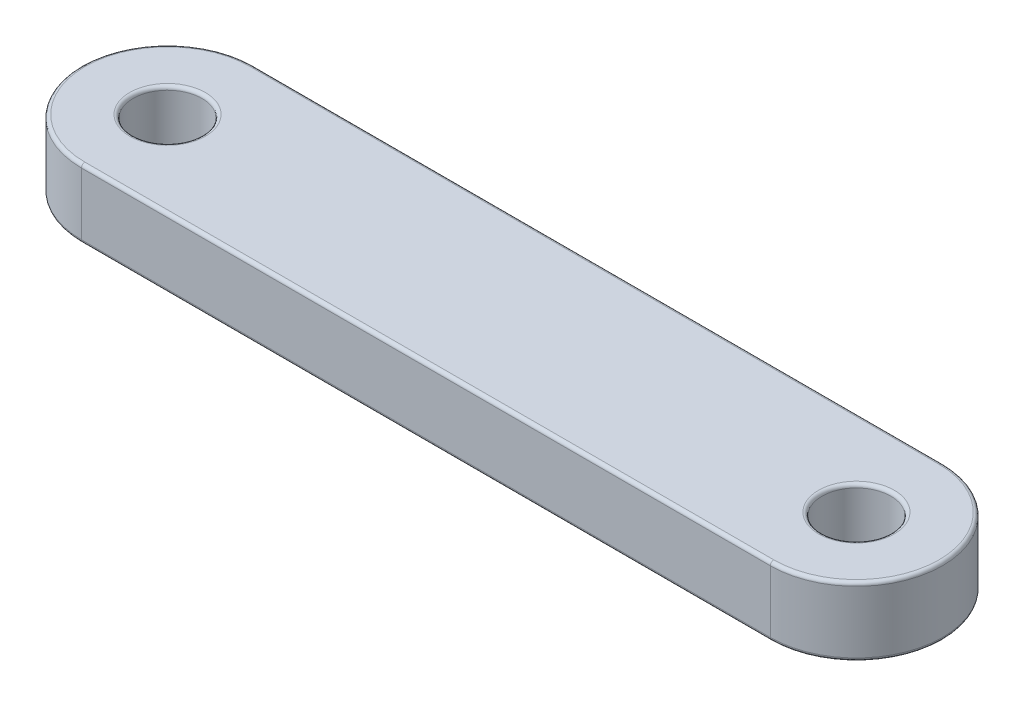
ISO-10303-21;
HEADER;
FILE_DESCRIPTION(('STEP AP214'),'2;1');
FILE_NAME('part.step','',(''),(''),'','','');
FILE_SCHEMA(('AUTOMOTIVE_DESIGN { 1 0 10303 214 1 1 1 1 }'));
ENDSEC;
DATA;
#1=APPLICATION_CONTEXT('core data for automotive mechanical design processes');
#2=APPLICATION_PROTOCOL_DEFINITION('international standard','automotive_design',2000,#1);
#3=PRODUCT_CONTEXT('',#1,'mechanical');
#4=PRODUCT('Part','Part','',(#3));
#5=PRODUCT_RELATED_PRODUCT_CATEGORY('part','',(#4));
#6=PRODUCT_DEFINITION_FORMATION('','',#4);
#7=PRODUCT_DEFINITION_CONTEXT('part definition',#1,'design');
#8=PRODUCT_DEFINITION('design','',#6,#7);
#9=PRODUCT_DEFINITION_SHAPE('','',#8);
#10=(LENGTH_UNIT() NAMED_UNIT(*) SI_UNIT(.MILLI.,.METRE.));
#11=(NAMED_UNIT(*) PLANE_ANGLE_UNIT() SI_UNIT($,.RADIAN.));
#12=(NAMED_UNIT(*) SI_UNIT($,.STERADIAN.) SOLID_ANGLE_UNIT());
#13=UNCERTAINTY_MEASURE_WITH_UNIT(LENGTH_MEASURE(1.E-05),#10,'distance_accuracy_value','');
#14=(GEOMETRIC_REPRESENTATION_CONTEXT(3) GLOBAL_UNCERTAINTY_ASSIGNED_CONTEXT((#13)) GLOBAL_UNIT_ASSIGNED_CONTEXT((#10,
#11,#12)) REPRESENTATION_CONTEXT('',''));
#15=CARTESIAN_POINT('',(0.,0.,0.));
#16=DIRECTION('',(0.,0.,1.));
#17=DIRECTION('',(1.,0.,0.));
#18=AXIS2_PLACEMENT_3D('',#15,#16,#17);
#19=CARTESIAN_POINT('',(-12.5,11.25,0.));
#20=DIRECTION('',(0.,1.,0.));
#21=DIRECTION('',(0.,0.,1.));
#22=AXIS2_PLACEMENT_3D('',#19,#20,#21);
#23=PLANE('',#22);
#24=CARTESIAN_POINT('',(12.5,11.25,0.));
#25=DIRECTION('',(0.,1.,0.));
#26=DIRECTION('',(0.,0.,1.));
#27=AXIS2_PLACEMENT_3D('',#24,#25,#26);
#28=CIRCLE('',#27,1.375);
#29=CARTESIAN_POINT('',(12.5,11.25,1.37499999999998));
#30=VERTEX_POINT('',#29);
#31=EDGE_CURVE('E11',#30,#30,#28,.F.);
#32=ORIENTED_EDGE('',*,*,#31,.T.);
#33=EDGE_LOOP('',(#32));
#34=FACE_BOUND('',#33,.T.);
#35=CARTESIAN_POINT('',(12.5,11.25,0.));
#36=DIRECTION('',(0.,1.,0.));
#37=DIRECTION('',(0.,0.,1.));
#38=AXIS2_PLACEMENT_3D('',#35,#36,#37);
#39=CIRCLE('',#38,3.);
#40=CARTESIAN_POINT('',(12.5,11.25,2.99999999999998));
#41=VERTEX_POINT('',#40);
#42=CARTESIAN_POINT('',(12.5,11.25,-3.00000000000002));
#43=VERTEX_POINT('',#42);
#44=EDGE_CURVE('E53',#41,#43,#39,.T.);
#45=ORIENTED_EDGE('',*,*,#44,.T.);
#46=DIRECTION('',(-1.,0.,0.));
#47=VECTOR('',#46,1.);
#48=CARTESIAN_POINT('',(-12.5,11.25,-3.00000000000002));
#49=LINE('',#48,#47);
#50=CARTESIAN_POINT('',(-12.5,11.25,-3.00000000000002));
#51=VERTEX_POINT('',#50);
#52=EDGE_CURVE('E45',#43,#51,#49,.T.);
#53=ORIENTED_EDGE('',*,*,#52,.T.);
#54=CARTESIAN_POINT('',(-12.5,11.25,0.));
#55=DIRECTION('',(0.,1.,0.));
#56=DIRECTION('',(0.,0.,1.));
#57=AXIS2_PLACEMENT_3D('',#54,#55,#56);
#58=CIRCLE('',#57,3.);
#59=CARTESIAN_POINT('',(-12.5,11.25,2.99999999999998));
#60=VERTEX_POINT('',#59);
#61=EDGE_CURVE('E171',#51,#60,#58,.T.);
#62=ORIENTED_EDGE('',*,*,#61,.T.);
#63=DIRECTION('',(1.,0.,0.));
#64=VECTOR('',#63,1.);
#65=CARTESIAN_POINT('',(12.5,11.25,2.99999999999998));
#66=LINE('',#65,#64);
#67=EDGE_CURVE('E58',#60,#41,#66,.T.);
#68=ORIENTED_EDGE('',*,*,#67,.T.);
#69=EDGE_LOOP('',(#45,#53,#62,#68));
#70=FACE_BOUND('',#69,.T.);
#71=CARTESIAN_POINT('',(-12.5,11.25,0.));
#72=DIRECTION('',(0.,1.,0.));
#73=DIRECTION('',(0.,0.,1.));
#74=AXIS2_PLACEMENT_3D('',#71,#72,#73);
#75=CIRCLE('',#74,1.375);
#76=CARTESIAN_POINT('',(-12.5,11.25,1.37499999999998));
#77=VERTEX_POINT('',#76);
#78=EDGE_CURVE('E168',#77,#77,#75,.F.);
#79=ORIENTED_EDGE('',*,*,#78,.T.);
#80=EDGE_LOOP('',(#79));
#81=FACE_BOUND('',#80,.T.);
#82=ADVANCED_FACE('F36',(#34,#70,#81),#23,.T.);
#83=CARTESIAN_POINT('',(-12.5,8.75,0.));
#84=DIRECTION('',(0.,1.,0.));
#85=DIRECTION('',(0.,0.,1.));
#86=AXIS2_PLACEMENT_3D('',#83,#84,#85);
#87=PLANE('',#86);
#88=CARTESIAN_POINT('',(12.5,8.75,0.));
#89=DIRECTION('',(0.,1.,0.));
#90=DIRECTION('',(0.,0.,1.));
#91=AXIS2_PLACEMENT_3D('',#88,#89,#90);
#92=CIRCLE('',#91,1.375);
#93=CARTESIAN_POINT('',(12.5,8.75,1.37499999999998));
#94=VERTEX_POINT('',#93);
#95=EDGE_CURVE('E133',#94,#94,#92,.T.);
#96=ORIENTED_EDGE('',*,*,#95,.T.);
#97=EDGE_LOOP('',(#96));
#98=FACE_BOUND('',#97,.T.);
#99=CARTESIAN_POINT('',(-12.5,8.75,0.));
#100=DIRECTION('',(0.,1.,0.));
#101=DIRECTION('',(0.,0.,1.));
#102=AXIS2_PLACEMENT_3D('',#99,#100,#101);
#103=CIRCLE('',#102,1.375);
#104=CARTESIAN_POINT('',(-12.5,8.75,1.37499999999998));
#105=VERTEX_POINT('',#104);
#106=EDGE_CURVE('E130',#105,#105,#103,.T.);
#107=ORIENTED_EDGE('',*,*,#106,.T.);
#108=EDGE_LOOP('',(#107));
#109=FACE_BOUND('',#108,.T.);
#110=CARTESIAN_POINT('',(12.5,8.75,0.));
#111=DIRECTION('',(0.,1.,0.));
#112=DIRECTION('',(0.,0.,1.));
#113=AXIS2_PLACEMENT_3D('',#110,#111,#112);
#114=CIRCLE('',#113,3.);
#115=CARTESIAN_POINT('',(12.5,8.75,-3.00000000000002));
#116=VERTEX_POINT('',#115);
#117=CARTESIAN_POINT('',(12.5,8.75,2.99999999999998));
#118=VERTEX_POINT('',#117);
#119=EDGE_CURVE('E129',#116,#118,#114,.F.);
#120=ORIENTED_EDGE('',*,*,#119,.T.);
#121=DIRECTION('',(1.,0.,0.));
#122=VECTOR('',#121,1.);
#123=CARTESIAN_POINT('',(-12.5,8.75,2.99999999999998));
#124=LINE('',#123,#122);
#125=CARTESIAN_POINT('',(-12.5,8.75,2.99999999999998));
#126=VERTEX_POINT('',#125);
#127=EDGE_CURVE('E108',#118,#126,#124,.F.);
#128=ORIENTED_EDGE('',*,*,#127,.T.);
#129=CARTESIAN_POINT('',(-12.5,8.75,0.));
#130=DIRECTION('',(0.,1.,0.));
#131=DIRECTION('',(0.,0.,1.));
#132=AXIS2_PLACEMENT_3D('',#129,#130,#131);
#133=CIRCLE('',#132,3.);
#134=CARTESIAN_POINT('',(-12.5,8.75,-3.00000000000002));
#135=VERTEX_POINT('',#134);
#136=EDGE_CURVE('E118',#126,#135,#133,.F.);
#137=ORIENTED_EDGE('',*,*,#136,.T.);
#138=DIRECTION('',(-1.,0.,0.));
#139=VECTOR('',#138,1.);
#140=CARTESIAN_POINT('',(-12.5,8.75,-3.00000000000002));
#141=LINE('',#140,#139);
#142=EDGE_CURVE('E124',#135,#116,#141,.F.);
#143=ORIENTED_EDGE('',*,*,#142,.T.);
#144=EDGE_LOOP('',(#120,#128,#137,#143));
#145=FACE_BOUND('',#144,.T.);
#146=ADVANCED_FACE('F127',(#98,#109,#145),#87,.F.);
#147=CARTESIAN_POINT('',(-12.5,11.25,0.));
#148=DIRECTION('',(0.,-1.,0.));
#149=DIRECTION('',(0.,0.,-1.));
#150=AXIS2_PLACEMENT_3D('',#147,#148,#149);
#151=CYLINDRICAL_SURFACE('',#150,3.125);
#152=DIRECTION('',(0.,-1.,0.));
#153=VECTOR('',#152,1.);
#154=CARTESIAN_POINT('',(-12.5,11.25,-3.12500000000002));
#155=LINE('',#154,#153);
#156=CARTESIAN_POINT('',(-12.5,11.125,-3.12500000000002));
#157=VERTEX_POINT('',#156);
#158=CARTESIAN_POINT('',(-12.5,8.875,-3.12500000000002));
#159=VERTEX_POINT('',#158);
#160=EDGE_CURVE('E180',#157,#159,#155,.T.);
#161=ORIENTED_EDGE('',*,*,#160,.T.);
#162=CARTESIAN_POINT('',(-12.5,8.875,0.));
#163=DIRECTION('',(0.,1.,0.));
#164=DIRECTION('',(0.,0.,1.));
#165=AXIS2_PLACEMENT_3D('',#162,#163,#164);
#166=CIRCLE('',#165,3.125);
#167=CARTESIAN_POINT('',(-12.5,8.875,3.12499999999998));
#168=VERTEX_POINT('',#167);
#169=EDGE_CURVE('E166',#159,#168,#166,.T.);
#170=ORIENTED_EDGE('',*,*,#169,.T.);
#171=DIRECTION('',(0.,-1.,0.));
#172=VECTOR('',#171,1.);
#173=CARTESIAN_POINT('',(-12.5,11.25,3.12499999999998));
#174=LINE('',#173,#172);
#175=CARTESIAN_POINT('',(-12.5,11.125,3.12499999999998));
#176=VERTEX_POINT('',#175);
#177=EDGE_CURVE('E125',#176,#168,#174,.T.);
#178=ORIENTED_EDGE('',*,*,#177,.F.);
#179=CARTESIAN_POINT('',(-12.5,11.125,0.));
#180=DIRECTION('',(0.,1.,0.));
#181=DIRECTION('',(0.,0.,1.));
#182=AXIS2_PLACEMENT_3D('',#179,#180,#181);
#183=CIRCLE('',#182,3.125);
#184=EDGE_CURVE('E164',#176,#157,#183,.F.);
#185=ORIENTED_EDGE('',*,*,#184,.T.);
#186=EDGE_LOOP('',(#161,#170,#178,#185));
#187=FACE_BOUND('',#186,.T.);
#188=ADVANCED_FACE('F206',(#187),#151,.T.);
#189=CARTESIAN_POINT('',(-12.5,11.25,3.12499999999998));
#190=DIRECTION('',(0.,0.,-1.));
#191=DIRECTION('',(-1.,0.,0.));
#192=AXIS2_PLACEMENT_3D('',#189,#190,#191);
#193=PLANE('',#192);
#194=ORIENTED_EDGE('',*,*,#177,.T.);
#195=DIRECTION('',(1.,0.,0.));
#196=VECTOR('',#195,1.);
#197=CARTESIAN_POINT('',(-12.5,8.875,3.12499999999998));
#198=LINE('',#197,#196);
#199=CARTESIAN_POINT('',(12.5,8.875,3.12499999999998));
#200=VERTEX_POINT('',#199);
#201=EDGE_CURVE('E111',#168,#200,#198,.T.);
#202=ORIENTED_EDGE('',*,*,#201,.T.);
#203=DIRECTION('',(0.,-1.,0.));
#204=VECTOR('',#203,1.);
#205=CARTESIAN_POINT('',(12.5,11.25,3.12499999999998));
#206=LINE('',#205,#204);
#207=CARTESIAN_POINT('',(12.5,11.125,3.12499999999998));
#208=VERTEX_POINT('',#207);
#209=EDGE_CURVE('E203',#208,#200,#206,.T.);
#210=ORIENTED_EDGE('',*,*,#209,.F.);
#211=DIRECTION('',(1.,0.,0.));
#212=VECTOR('',#211,1.);
#213=CARTESIAN_POINT('',(-12.5,11.125,3.12499999999998));
#214=LINE('',#213,#212);
#215=EDGE_CURVE('E152',#208,#176,#214,.F.);
#216=ORIENTED_EDGE('',*,*,#215,.T.);
#217=EDGE_LOOP('',(#194,#202,#210,#216));
#218=FACE_BOUND('',#217,.T.);
#219=ADVANCED_FACE('F201',(#218),#193,.F.);
#220=CARTESIAN_POINT('',(12.5,11.25,0.));
#221=DIRECTION('',(0.,-1.,0.));
#222=DIRECTION('',(0.,0.,-1.));
#223=AXIS2_PLACEMENT_3D('',#220,#221,#222);
#224=CYLINDRICAL_SURFACE('',#223,3.125);
#225=ORIENTED_EDGE('',*,*,#209,.T.);
#226=CARTESIAN_POINT('',(12.5,8.875,0.));
#227=DIRECTION('',(0.,1.,0.));
#228=DIRECTION('',(0.,0.,1.));
#229=AXIS2_PLACEMENT_3D('',#226,#227,#228);
#230=CIRCLE('',#229,3.125);
#231=CARTESIAN_POINT('',(12.5,8.875,-3.12500000000002));
#232=VERTEX_POINT('',#231);
#233=EDGE_CURVE('E157',#200,#232,#230,.T.);
#234=ORIENTED_EDGE('',*,*,#233,.T.);
#235=DIRECTION('',(0.,-1.,0.));
#236=VECTOR('',#235,1.);
#237=CARTESIAN_POINT('',(12.5,11.25,-3.12500000000002));
#238=LINE('',#237,#236);
#239=CARTESIAN_POINT('',(12.5,11.125,-3.12500000000002));
#240=VERTEX_POINT('',#239);
#241=EDGE_CURVE('E209',#240,#232,#238,.T.);
#242=ORIENTED_EDGE('',*,*,#241,.F.);
#243=CARTESIAN_POINT('',(12.5,11.125,0.));
#244=DIRECTION('',(0.,1.,0.));
#245=DIRECTION('',(0.,0.,1.));
#246=AXIS2_PLACEMENT_3D('',#243,#244,#245);
#247=CIRCLE('',#246,3.125);
#248=EDGE_CURVE('E155',#240,#208,#247,.F.);
#249=ORIENTED_EDGE('',*,*,#248,.T.);
#250=EDGE_LOOP('',(#225,#234,#242,#249));
#251=FACE_BOUND('',#250,.T.);
#252=ADVANCED_FACE('F222',(#251),#224,.T.);
#253=CARTESIAN_POINT('',(-12.5,11.25,-3.12500000000002));
#254=DIRECTION('',(0.,0.,1.));
#255=DIRECTION('',(1.,0.,0.));
#256=AXIS2_PLACEMENT_3D('',#253,#254,#255);
#257=PLANE('',#256);
#258=ORIENTED_EDGE('',*,*,#241,.T.);
#259=DIRECTION('',(-1.,0.,0.));
#260=VECTOR('',#259,1.);
#261=CARTESIAN_POINT('',(-12.5,8.875,-3.12500000000002));
#262=LINE('',#261,#260);
#263=EDGE_CURVE('E162',#232,#159,#262,.T.);
#264=ORIENTED_EDGE('',*,*,#263,.T.);
#265=ORIENTED_EDGE('',*,*,#160,.F.);
#266=DIRECTION('',(-1.,0.,0.));
#267=VECTOR('',#266,1.);
#268=CARTESIAN_POINT('',(12.5,11.125,-3.12500000000002));
#269=LINE('',#268,#267);
#270=EDGE_CURVE('E159',#157,#240,#269,.F.);
#271=ORIENTED_EDGE('',*,*,#270,.T.);
#272=EDGE_LOOP('',(#258,#264,#265,#271));
#273=FACE_BOUND('',#272,.T.);
#274=ADVANCED_FACE('F226',(#273),#257,.F.);
#275=CARTESIAN_POINT('',(-12.5,11.25,0.));
#276=DIRECTION('',(0.,-1.,0.));
#277=DIRECTION('',(0.,0.,-1.));
#278=AXIS2_PLACEMENT_3D('',#275,#276,#277);
#279=CYLINDRICAL_SURFACE('',#278,1.25);
#280=CARTESIAN_POINT('',(-12.5,8.875,0.));
#281=DIRECTION('',(0.,1.,0.));
#282=DIRECTION('',(0.,0.,1.));
#283=AXIS2_PLACEMENT_3D('',#280,#281,#282);
#284=CIRCLE('',#283,1.25);
#285=CARTESIAN_POINT('',(-12.5,8.875,1.24999999999998));
#286=VERTEX_POINT('',#285);
#287=EDGE_CURVE('E149',#286,#286,#284,.F.);
#288=ORIENTED_EDGE('',*,*,#287,.T.);
#289=EDGE_LOOP('',(#288));
#290=FACE_BOUND('',#289,.T.);
#291=CARTESIAN_POINT('',(-12.5,11.125,0.));
#292=DIRECTION('',(0.,1.,0.));
#293=DIRECTION('',(0.,0.,1.));
#294=AXIS2_PLACEMENT_3D('',#291,#292,#293);
#295=CIRCLE('',#294,1.25);
#296=CARTESIAN_POINT('',(-12.5,11.125,1.24999999999998));
#297=VERTEX_POINT('',#296);
#298=EDGE_CURVE('E146',#297,#297,#295,.T.);
#299=ORIENTED_EDGE('',*,*,#298,.T.);
#300=EDGE_LOOP('',(#299));
#301=FACE_BOUND('',#300,.T.);
#302=ADVANCED_FACE('F242',(#290,#301),#279,.F.);
#303=CARTESIAN_POINT('',(12.5,11.25,0.));
#304=DIRECTION('',(0.,-1.,0.));
#305=DIRECTION('',(0.,0.,-1.));
#306=AXIS2_PLACEMENT_3D('',#303,#304,#305);
#307=CYLINDRICAL_SURFACE('',#306,1.25);
#308=CARTESIAN_POINT('',(12.5,8.875,0.));
#309=DIRECTION('',(0.,1.,0.));
#310=DIRECTION('',(0.,0.,1.));
#311=AXIS2_PLACEMENT_3D('',#308,#309,#310);
#312=CIRCLE('',#311,1.25);
#313=CARTESIAN_POINT('',(12.5,8.875,1.24999999999998));
#314=VERTEX_POINT('',#313);
#315=EDGE_CURVE('E143',#314,#314,#312,.F.);
#316=ORIENTED_EDGE('',*,*,#315,.T.);
#317=EDGE_LOOP('',(#316));
#318=FACE_BOUND('',#317,.T.);
#319=CARTESIAN_POINT('',(12.5,11.125,0.));
#320=DIRECTION('',(0.,1.,0.));
#321=DIRECTION('',(0.,0.,1.));
#322=AXIS2_PLACEMENT_3D('',#319,#320,#321);
#323=CIRCLE('',#322,1.25);
#324=CARTESIAN_POINT('',(12.5,11.125,1.24999999999998));
#325=VERTEX_POINT('',#324);
#326=EDGE_CURVE('E140',#325,#325,#323,.T.);
#327=ORIENTED_EDGE('',*,*,#326,.T.);
#328=EDGE_LOOP('',(#327));
#329=FACE_BOUND('',#328,.T.);
#330=ADVANCED_FACE('F244',(#318,#329),#307,.F.);
#331=CARTESIAN_POINT('',(12.5,8.875,0.));
#332=DIRECTION('',(0.,1.,0.));
#333=DIRECTION('',(0.,0.,1.));
#334=AXIS2_PLACEMENT_3D('',#331,#332,#333);
#335=TOROIDAL_SURFACE('',#334,1.375,0.125);
#336=ORIENTED_EDGE('',*,*,#315,.F.);
#337=EDGE_LOOP('',(#336));
#338=FACE_BOUND('',#337,.T.);
#339=ORIENTED_EDGE('',*,*,#95,.F.);
#340=EDGE_LOOP('',(#339));
#341=FACE_BOUND('',#340,.T.);
#342=ADVANCED_FACE('F251',(#338,#341),#335,.T.);
#343=CARTESIAN_POINT('',(-12.5,8.875,0.));
#344=DIRECTION('',(0.,1.,0.));
#345=DIRECTION('',(0.,0.,1.));
#346=AXIS2_PLACEMENT_3D('',#343,#344,#345);
#347=TOROIDAL_SURFACE('',#346,1.375,0.125);
#348=ORIENTED_EDGE('',*,*,#287,.F.);
#349=EDGE_LOOP('',(#348));
#350=FACE_BOUND('',#349,.T.);
#351=ORIENTED_EDGE('',*,*,#106,.F.);
#352=EDGE_LOOP('',(#351));
#353=FACE_BOUND('',#352,.T.);
#354=ADVANCED_FACE('F267',(#350,#353),#347,.T.);
#355=CARTESIAN_POINT('',(-12.5,8.875,-3.00000000000002));
#356=DIRECTION('',(-1.,0.,0.));
#357=DIRECTION('',(0.,0.,1.));
#358=AXIS2_PLACEMENT_3D('',#355,#356,#357);
#359=CYLINDRICAL_SURFACE('',#358,0.125);
#360=CARTESIAN_POINT('',(12.5,8.875,-3.00000000000002));
#361=DIRECTION('',(1.,0.,0.));
#362=DIRECTION('',(0.,0.,-1.));
#363=AXIS2_PLACEMENT_3D('',#360,#361,#362);
#364=CIRCLE('',#363,0.125);
#365=EDGE_CURVE('E114',#116,#232,#364,.T.);
#366=ORIENTED_EDGE('',*,*,#365,.F.);
#367=ORIENTED_EDGE('',*,*,#142,.F.);
#368=CARTESIAN_POINT('',(-12.5,8.875,-3.00000000000002));
#369=DIRECTION('',(-1.,0.,0.));
#370=DIRECTION('',(0.,0.,1.));
#371=AXIS2_PLACEMENT_3D('',#368,#369,#370);
#372=CIRCLE('',#371,0.125);
#373=EDGE_CURVE('E121',#159,#135,#372,.T.);
#374=ORIENTED_EDGE('',*,*,#373,.F.);
#375=ORIENTED_EDGE('',*,*,#263,.F.);
#376=EDGE_LOOP('',(#366,#367,#374,#375));
#377=FACE_BOUND('',#376,.T.);
#378=ADVANCED_FACE('F215',(#377),#359,.T.);
#379=CARTESIAN_POINT('',(-12.5,8.875,0.));
#380=DIRECTION('',(0.,1.,0.));
#381=DIRECTION('',(0.,0.,1.));
#382=AXIS2_PLACEMENT_3D('',#379,#380,#381);
#383=TOROIDAL_SURFACE('',#382,3.,0.125);
#384=ORIENTED_EDGE('',*,*,#373,.T.);
#385=ORIENTED_EDGE('',*,*,#136,.F.);
#386=CARTESIAN_POINT('',(-12.5,8.875,2.99999999999998));
#387=DIRECTION('',(1.,0.,0.));
#388=DIRECTION('',(0.,0.,-1.));
#389=AXIS2_PLACEMENT_3D('',#386,#387,#388);
#390=CIRCLE('',#389,0.125);
#391=EDGE_CURVE('E104',#168,#126,#390,.T.);
#392=ORIENTED_EDGE('',*,*,#391,.F.);
#393=ORIENTED_EDGE('',*,*,#169,.F.);
#394=EDGE_LOOP('',(#384,#385,#392,#393));
#395=FACE_BOUND('',#394,.T.);
#396=ADVANCED_FACE('F119',(#395),#383,.T.);
#397=CARTESIAN_POINT('',(12.5,8.875,0.));
#398=DIRECTION('',(0.,1.,0.));
#399=DIRECTION('',(0.,0.,1.));
#400=AXIS2_PLACEMENT_3D('',#397,#398,#399);
#401=TOROIDAL_SURFACE('',#400,3.,0.125);
#402=ORIENTED_EDGE('',*,*,#365,.T.);
#403=ORIENTED_EDGE('',*,*,#233,.F.);
#404=CARTESIAN_POINT('',(12.5,8.875,2.99999999999998));
#405=DIRECTION('',(-1.,0.,0.));
#406=DIRECTION('',(0.,0.,1.));
#407=AXIS2_PLACEMENT_3D('',#404,#405,#406);
#408=CIRCLE('',#407,0.125);
#409=EDGE_CURVE('E115',#118,#200,#408,.T.);
#410=ORIENTED_EDGE('',*,*,#409,.F.);
#411=ORIENTED_EDGE('',*,*,#119,.F.);
#412=EDGE_LOOP('',(#402,#403,#410,#411));
#413=FACE_BOUND('',#412,.T.);
#414=ADVANCED_FACE('F218',(#413),#401,.T.);
#415=CARTESIAN_POINT('',(-12.5,8.875,2.99999999999998));
#416=DIRECTION('',(1.,0.,0.));
#417=DIRECTION('',(0.,0.,-1.));
#418=AXIS2_PLACEMENT_3D('',#415,#416,#417);
#419=CYLINDRICAL_SURFACE('',#418,0.125);
#420=ORIENTED_EDGE('',*,*,#391,.T.);
#421=ORIENTED_EDGE('',*,*,#127,.F.);
#422=ORIENTED_EDGE('',*,*,#409,.T.);
#423=ORIENTED_EDGE('',*,*,#201,.F.);
#424=EDGE_LOOP('',(#420,#421,#422,#423));
#425=FACE_BOUND('',#424,.T.);
#426=ADVANCED_FACE('F106',(#425),#419,.T.);
#427=CARTESIAN_POINT('',(12.5,11.125,0.));
#428=DIRECTION('',(0.,1.,0.));
#429=DIRECTION('',(0.,0.,1.));
#430=AXIS2_PLACEMENT_3D('',#427,#428,#429);
#431=TOROIDAL_SURFACE('',#430,1.375,0.125);
#432=ORIENTED_EDGE('',*,*,#31,.F.);
#433=EDGE_LOOP('',(#432));
#434=FACE_BOUND('',#433,.T.);
#435=ORIENTED_EDGE('',*,*,#326,.F.);
#436=EDGE_LOOP('',(#435));
#437=FACE_BOUND('',#436,.T.);
#438=ADVANCED_FACE('F274',(#434,#437),#431,.T.);
#439=CARTESIAN_POINT('',(-12.5,11.125,2.99999999999998));
#440=DIRECTION('',(-1.,0.,0.));
#441=DIRECTION('',(0.,0.,1.));
#442=AXIS2_PLACEMENT_3D('',#439,#440,#441);
#443=CYLINDRICAL_SURFACE('',#442,0.125);
#444=CARTESIAN_POINT('',(-12.5,11.125,2.99999999999998));
#445=DIRECTION('',(-1.,0.,0.));
#446=DIRECTION('',(0.,0.,1.));
#447=AXIS2_PLACEMENT_3D('',#444,#445,#446);
#448=CIRCLE('',#447,0.125);
#449=EDGE_CURVE('E184',#176,#60,#448,.T.);
#450=ORIENTED_EDGE('',*,*,#449,.F.);
#451=ORIENTED_EDGE('',*,*,#215,.F.);
#452=CARTESIAN_POINT('',(12.5,11.125,2.99999999999998));
#453=DIRECTION('',(1.,0.,0.));
#454=DIRECTION('',(0.,0.,-1.));
#455=AXIS2_PLACEMENT_3D('',#452,#453,#454);
#456=CIRCLE('',#455,0.125);
#457=EDGE_CURVE('E40',#41,#208,#456,.T.);
#458=ORIENTED_EDGE('',*,*,#457,.F.);
#459=ORIENTED_EDGE('',*,*,#67,.F.);
#460=EDGE_LOOP('',(#450,#451,#458,#459));
#461=FACE_BOUND('',#460,.T.);
#462=ADVANCED_FACE('F196',(#461),#443,.T.);
#463=CARTESIAN_POINT('',(12.5,11.125,0.));
#464=DIRECTION('',(0.,1.,0.));
#465=DIRECTION('',(0.,0.,1.));
#466=AXIS2_PLACEMENT_3D('',#463,#464,#465);
#467=TOROIDAL_SURFACE('',#466,3.,0.125);
#468=ORIENTED_EDGE('',*,*,#457,.T.);
#469=ORIENTED_EDGE('',*,*,#248,.F.);
#470=CARTESIAN_POINT('',(12.5,11.125,-3.00000000000002));
#471=DIRECTION('',(-1.,0.,0.));
#472=DIRECTION('',(0.,0.,1.));
#473=AXIS2_PLACEMENT_3D('',#470,#471,#472);
#474=CIRCLE('',#473,0.125);
#475=EDGE_CURVE('E183',#43,#240,#474,.T.);
#476=ORIENTED_EDGE('',*,*,#475,.F.);
#477=ORIENTED_EDGE('',*,*,#44,.F.);
#478=EDGE_LOOP('',(#468,#469,#476,#477));
#479=FACE_BOUND('',#478,.T.);
#480=ADVANCED_FACE('F193',(#479),#467,.T.);
#481=CARTESIAN_POINT('',(-12.5,11.125,0.));
#482=DIRECTION('',(0.,1.,0.));
#483=DIRECTION('',(0.,0.,1.));
#484=AXIS2_PLACEMENT_3D('',#481,#482,#483);
#485=TOROIDAL_SURFACE('',#484,3.,0.125);
#486=ORIENTED_EDGE('',*,*,#449,.T.);
#487=ORIENTED_EDGE('',*,*,#61,.F.);
#488=CARTESIAN_POINT('',(-12.5,11.125,-3.00000000000002));
#489=DIRECTION('',(1.,0.,0.));
#490=DIRECTION('',(0.,0.,-1.));
#491=AXIS2_PLACEMENT_3D('',#488,#489,#490);
#492=CIRCLE('',#491,0.125);
#493=EDGE_CURVE('E181',#157,#51,#492,.T.);
#494=ORIENTED_EDGE('',*,*,#493,.F.);
#495=ORIENTED_EDGE('',*,*,#184,.F.);
#496=EDGE_LOOP('',(#486,#487,#494,#495));
#497=FACE_BOUND('',#496,.T.);
#498=ADVANCED_FACE('F231',(#497),#485,.T.);
#499=CARTESIAN_POINT('',(-12.5,11.125,-3.00000000000002));
#500=DIRECTION('',(1.,0.,0.));
#501=DIRECTION('',(0.,0.,-1.));
#502=AXIS2_PLACEMENT_3D('',#499,#500,#501);
#503=CYLINDRICAL_SURFACE('',#502,0.125);
#504=ORIENTED_EDGE('',*,*,#475,.T.);
#505=ORIENTED_EDGE('',*,*,#270,.F.);
#506=ORIENTED_EDGE('',*,*,#493,.T.);
#507=ORIENTED_EDGE('',*,*,#52,.F.);
#508=EDGE_LOOP('',(#504,#505,#506,#507));
#509=FACE_BOUND('',#508,.T.);
#510=ADVANCED_FACE('F229',(#509),#503,.T.);
#511=CARTESIAN_POINT('',(-12.5,11.125,0.));
#512=DIRECTION('',(0.,1.,0.));
#513=DIRECTION('',(0.,0.,1.));
#514=AXIS2_PLACEMENT_3D('',#511,#512,#513);
#515=TOROIDAL_SURFACE('',#514,1.375,0.125);
#516=ORIENTED_EDGE('',*,*,#78,.F.);
#517=EDGE_LOOP('',(#516));
#518=FACE_BOUND('',#517,.T.);
#519=ORIENTED_EDGE('',*,*,#298,.F.);
#520=EDGE_LOOP('',(#519));
#521=FACE_BOUND('',#520,.T.);
#522=ADVANCED_FACE('F38',(#518,#521),#515,.T.);
#523=CLOSED_SHELL('',(#82,#146,#188,#219,#252,#274,#302,#330,#342,#354,#378,#396,#414,#426,#438,
#462,#480,#498,#510,#522));
#524=MANIFOLD_SOLID_BREP('B2',#523);
#525=ADVANCED_BREP_SHAPE_REPRESENTATION('',(#18,#524),#14);
#526=SHAPE_DEFINITION_REPRESENTATION(#9,#525);
ENDSEC;
END-ISO-10303-21;
